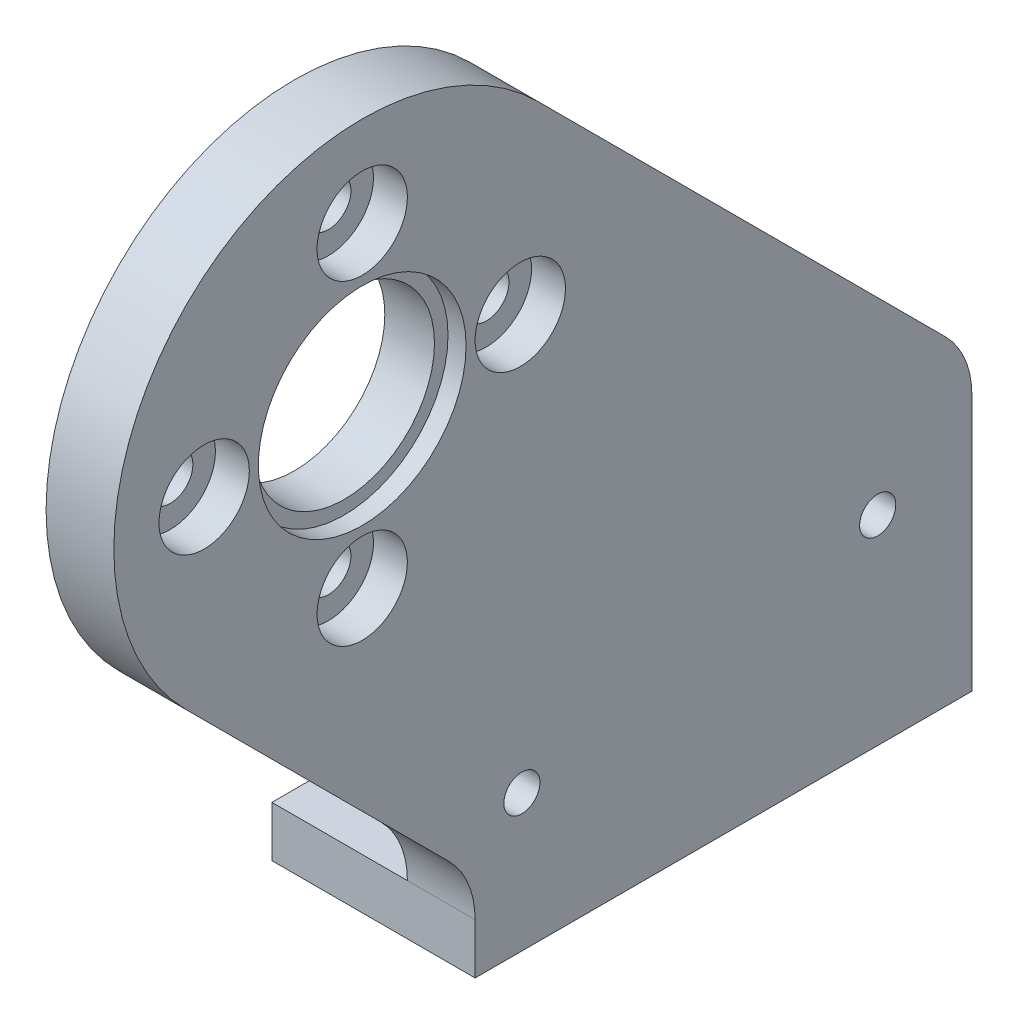
ISO-10303-21;
HEADER;
FILE_DESCRIPTION(('STEP AP214'),'2;1');
FILE_NAME('part.step','',(''),(''),'','','');
FILE_SCHEMA(('AUTOMOTIVE_DESIGN { 1 0 10303 214 1 1 1 1 }'));
ENDSEC;
DATA;
#1=APPLICATION_CONTEXT('core data for automotive mechanical design processes');
#2=APPLICATION_PROTOCOL_DEFINITION('international standard','automotive_design',2000,#1);
#3=PRODUCT_CONTEXT('',#1,'mechanical');
#4=PRODUCT('Part','Part','',(#3));
#5=PRODUCT_RELATED_PRODUCT_CATEGORY('part','',(#4));
#6=PRODUCT_DEFINITION_FORMATION('','',#4);
#7=PRODUCT_DEFINITION_CONTEXT('part definition',#1,'design');
#8=PRODUCT_DEFINITION('design','',#6,#7);
#9=PRODUCT_DEFINITION_SHAPE('','',#8);
#10=(LENGTH_UNIT() NAMED_UNIT(*) SI_UNIT(.MILLI.,.METRE.));
#11=(NAMED_UNIT(*) PLANE_ANGLE_UNIT() SI_UNIT($,.RADIAN.));
#12=(NAMED_UNIT(*) SI_UNIT($,.STERADIAN.) SOLID_ANGLE_UNIT());
#13=UNCERTAINTY_MEASURE_WITH_UNIT(LENGTH_MEASURE(1.E-05),#10,'distance_accuracy_value','');
#14=(GEOMETRIC_REPRESENTATION_CONTEXT(3) GLOBAL_UNCERTAINTY_ASSIGNED_CONTEXT((#13)) GLOBAL_UNIT_ASSIGNED_CONTEXT((#10,
#11,#12)) REPRESENTATION_CONTEXT('',''));
#15=CARTESIAN_POINT('',(0.,0.,0.));
#16=DIRECTION('',(0.,0.,1.));
#17=DIRECTION('',(1.,0.,0.));
#18=AXIS2_PLACEMENT_3D('',#15,#16,#17);
#19=CARTESIAN_POINT('',(69.5,-12.7999999999999,20.9999999999999));
#20=DIRECTION('',(-1.,0.,0.));
#21=DIRECTION('',(0.,0.,1.));
#22=AXIS2_PLACEMENT_3D('',#19,#20,#21);
#23=CYLINDRICAL_SURFACE('',#22,1.);
#24=CARTESIAN_POINT('',(60.,-12.7999999999999,20.9999999999999));
#25=DIRECTION('',(1.,0.,0.));
#26=DIRECTION('',(0.,0.,-1.));
#27=AXIS2_PLACEMENT_3D('',#24,#25,#26);
#28=CIRCLE('',#27,1.);
#29=CARTESIAN_POINT('',(60.,-12.7999999999999,19.9999999999999));
#30=VERTEX_POINT('',#29);
#31=EDGE_CURVE('E40',#30,#30,#28,.F.);
#32=ORIENTED_EDGE('',*,*,#31,.F.);
#33=EDGE_LOOP('',(#32));
#34=FACE_BOUND('',#33,.T.);
#35=CARTESIAN_POINT('',(58.5,-12.7999999999999,20.9999999999999));
#36=DIRECTION('',(-1.,0.,0.));
#37=DIRECTION('',(0.,0.,1.));
#38=AXIS2_PLACEMENT_3D('',#35,#36,#37);
#39=CIRCLE('',#38,1.);
#40=CARTESIAN_POINT('',(58.5,-12.7999999999999,21.9999999999999));
#41=VERTEX_POINT('',#40);
#42=EDGE_CURVE('E267',#41,#41,#39,.T.);
#43=ORIENTED_EDGE('',*,*,#42,.T.);
#44=EDGE_LOOP('',(#43));
#45=FACE_BOUND('',#44,.T.);
#46=ADVANCED_FACE('F36',(#34,#45),#23,.F.);
#47=CARTESIAN_POINT('',(69.5,-5.8,28.));
#48=DIRECTION('',(-1.,0.,0.));
#49=DIRECTION('',(0.,0.,1.));
#50=AXIS2_PLACEMENT_3D('',#47,#48,#49);
#51=CYLINDRICAL_SURFACE('',#50,1.);
#52=CARTESIAN_POINT('',(60.,-5.8,28.));
#53=DIRECTION('',(1.,0.,0.));
#54=DIRECTION('',(0.,0.,-1.));
#55=AXIS2_PLACEMENT_3D('',#52,#53,#54);
#56=CIRCLE('',#55,1.);
#57=CARTESIAN_POINT('',(60.,-5.8,27.));
#58=VERTEX_POINT('',#57);
#59=EDGE_CURVE('E252',#58,#58,#56,.F.);
#60=ORIENTED_EDGE('',*,*,#59,.F.);
#61=EDGE_LOOP('',(#60));
#62=FACE_BOUND('',#61,.T.);
#63=CARTESIAN_POINT('',(58.5,-5.8,28.));
#64=DIRECTION('',(-1.,0.,0.));
#65=DIRECTION('',(0.,0.,1.));
#66=AXIS2_PLACEMENT_3D('',#63,#64,#65);
#67=CIRCLE('',#66,1.);
#68=CARTESIAN_POINT('',(58.5,-5.8,29.));
#69=VERTEX_POINT('',#68);
#70=EDGE_CURVE('E269',#69,#69,#67,.T.);
#71=ORIENTED_EDGE('',*,*,#70,.T.);
#72=EDGE_LOOP('',(#71));
#73=FACE_BOUND('',#72,.T.);
#74=ADVANCED_FACE('F263',(#62,#73),#51,.F.);
#75=CARTESIAN_POINT('',(69.5,1.20000000000005,21.));
#76=DIRECTION('',(-1.,0.,0.));
#77=DIRECTION('',(0.,0.,1.));
#78=AXIS2_PLACEMENT_3D('',#75,#76,#77);
#79=CYLINDRICAL_SURFACE('',#78,1.);
#80=CARTESIAN_POINT('',(60.,1.20000000000005,21.));
#81=DIRECTION('',(1.,0.,0.));
#82=DIRECTION('',(0.,0.,-1.));
#83=AXIS2_PLACEMENT_3D('',#80,#81,#82);
#84=CIRCLE('',#83,1.);
#85=CARTESIAN_POINT('',(60.,1.20000000000005,20.));
#86=VERTEX_POINT('',#85);
#87=EDGE_CURVE('E152',#86,#86,#84,.F.);
#88=ORIENTED_EDGE('',*,*,#87,.F.);
#89=EDGE_LOOP('',(#88));
#90=FACE_BOUND('',#89,.T.);
#91=CARTESIAN_POINT('',(58.5,1.20000000000005,21.));
#92=DIRECTION('',(-1.,0.,0.));
#93=DIRECTION('',(0.,0.,1.));
#94=AXIS2_PLACEMENT_3D('',#91,#92,#93);
#95=CIRCLE('',#94,1.);
#96=CARTESIAN_POINT('',(58.5,1.20000000000005,22.));
#97=VERTEX_POINT('',#96);
#98=EDGE_CURVE('E273',#97,#97,#95,.T.);
#99=ORIENTED_EDGE('',*,*,#98,.T.);
#100=EDGE_LOOP('',(#99));
#101=FACE_BOUND('',#100,.T.);
#102=ADVANCED_FACE('F393',(#90,#101),#79,.F.);
#103=CARTESIAN_POINT('',(69.5,-5.79999999999995,14.));
#104=DIRECTION('',(-1.,0.,0.));
#105=DIRECTION('',(0.,0.,1.));
#106=AXIS2_PLACEMENT_3D('',#103,#104,#105);
#107=CYLINDRICAL_SURFACE('',#106,1.);
#108=CARTESIAN_POINT('',(60.,-5.79999999999995,14.));
#109=DIRECTION('',(1.,0.,0.));
#110=DIRECTION('',(0.,0.,-1.));
#111=AXIS2_PLACEMENT_3D('',#108,#109,#110);
#112=CIRCLE('',#111,1.);
#113=CARTESIAN_POINT('',(60.,-5.79999999999995,13.));
#114=VERTEX_POINT('',#113);
#115=EDGE_CURVE('E170',#114,#114,#112,.F.);
#116=ORIENTED_EDGE('',*,*,#115,.F.);
#117=EDGE_LOOP('',(#116));
#118=FACE_BOUND('',#117,.T.);
#119=CARTESIAN_POINT('',(58.5,-5.79999999999995,14.));
#120=DIRECTION('',(-1.,0.,0.));
#121=DIRECTION('',(0.,0.,1.));
#122=AXIS2_PLACEMENT_3D('',#119,#120,#121);
#123=CIRCLE('',#122,1.);
#124=CARTESIAN_POINT('',(58.5,-5.79999999999995,15.));
#125=VERTEX_POINT('',#124);
#126=EDGE_CURVE('E282',#125,#125,#123,.T.);
#127=ORIENTED_EDGE('',*,*,#126,.T.);
#128=EDGE_LOOP('',(#127));
#129=FACE_BOUND('',#128,.T.);
#130=ADVANCED_FACE('F396',(#118,#129),#107,.F.);
#131=CARTESIAN_POINT('',(60.5,-5.79999999999995,21.));
#132=DIRECTION('',(-1.,0.,0.));
#133=DIRECTION('',(0.,0.,-1.));
#134=AXIS2_PLACEMENT_3D('',#131,#132,#133);
#135=CYLINDRICAL_SURFACE('',#134,4.);
#136=CARTESIAN_POINT('',(60.7,-5.79999999999995,21.));
#137=DIRECTION('',(1.,0.,0.));
#138=DIRECTION('',(0.,0.,-1.));
#139=AXIS2_PLACEMENT_3D('',#136,#137,#138);
#140=CIRCLE('',#139,4.);
#141=CARTESIAN_POINT('',(60.7,-5.79999999999995,17.));
#142=VERTEX_POINT('',#141);
#143=EDGE_CURVE('E177',#142,#142,#140,.F.);
#144=ORIENTED_EDGE('',*,*,#143,.F.);
#145=EDGE_LOOP('',(#144));
#146=FACE_BOUND('',#145,.T.);
#147=CARTESIAN_POINT('',(58.5,-5.79999999999995,21.));
#148=DIRECTION('',(-1.,0.,0.));
#149=DIRECTION('',(0.,0.,1.));
#150=AXIS2_PLACEMENT_3D('',#147,#148,#149);
#151=CIRCLE('',#150,4.);
#152=CARTESIAN_POINT('',(58.5,-5.79999999999995,25.));
#153=VERTEX_POINT('',#152);
#154=EDGE_CURVE('E285',#153,#153,#151,.T.);
#155=ORIENTED_EDGE('',*,*,#154,.T.);
#156=EDGE_LOOP('',(#155));
#157=FACE_BOUND('',#156,.T.);
#158=ADVANCED_FACE('F403',(#146,#157),#135,.F.);
#159=CARTESIAN_POINT('',(61.61096680392,-28.0132034356,20.));
#160=DIRECTION('',(-1.,0.,0.));
#161=DIRECTION('',(0.,-0.707106781186548,0.707106781186548));
#162=AXIS2_PLACEMENT_3D('',#159,#160,#161);
#163=CYLINDRICAL_SURFACE('',#162,4.);
#164=DIRECTION('',(-1.,0.,0.));
#165=VECTOR('',#164,1.);
#166=CARTESIAN_POINT('',(61.5,-25.18477631085,17.171572875254));
#167=LINE('',#166,#165);
#168=CARTESIAN_POINT('',(61.5,-25.18477631085,17.171572875254));
#169=VERTEX_POINT('',#168);
#170=CARTESIAN_POINT('',(58.5,-25.1847763108514,17.1715728752554));
#171=VERTEX_POINT('',#170);
#172=EDGE_CURVE('E115',#169,#171,#167,.T.);
#173=ORIENTED_EDGE('',*,*,#172,.T.);
#174=CARTESIAN_POINT('',(58.5,-28.0132034356,20.));
#175=DIRECTION('',(1.,0.,0.));
#176=DIRECTION('',(0.,0.,1.));
#177=AXIS2_PLACEMENT_3D('',#174,#175,#176);
#178=CIRCLE('',#177,4.00000000000064);
#179=CARTESIAN_POINT('',(58.5,-28.0132034356,16.));
#180=VERTEX_POINT('',#179);
#181=EDGE_CURVE('E118',#180,#171,#178,.T.);
#182=ORIENTED_EDGE('',*,*,#181,.F.);
#183=DIRECTION('',(-1.,0.,0.));
#184=VECTOR('',#183,1.);
#185=CARTESIAN_POINT('',(61.54773426501,-28.0132034356,16.));
#186=LINE('',#185,#184);
#187=CARTESIAN_POINT('',(61.5,-28.0132034356,16.));
#188=VERTEX_POINT('',#187);
#189=EDGE_CURVE('E53',#188,#180,#186,.T.);
#190=ORIENTED_EDGE('',*,*,#189,.F.);
#191=CARTESIAN_POINT('',(61.5,-28.0132034356,20.));
#192=DIRECTION('',(-1.,0.,0.));
#193=DIRECTION('',(0.,0.707106781186548,-0.707106781186548));
#194=AXIS2_PLACEMENT_3D('',#191,#192,#193);
#195=CIRCLE('',#194,4.);
#196=EDGE_CURVE('E11',#169,#188,#195,.T.);
#197=ORIENTED_EDGE('',*,*,#196,.F.);
#198=EDGE_LOOP('',(#173,#182,#190,#197));
#199=FACE_BOUND('',#198,.T.);
#200=ADVANCED_FACE('F117',(#199),#163,.F.);
#201=CARTESIAN_POINT('',(60.93933982822,-28.86066017178,-6.));
#202=DIRECTION('',(0.,0.,-1.));
#203=DIRECTION('',(1.,0.,0.));
#204=AXIS2_PLACEMENT_3D('',#201,#202,#203);
#205=PLANE('',#204);
#206=DIRECTION('',(0.,-1.,2.95824592404915E-13));
#207=VECTOR('',#206,1.);
#208=CARTESIAN_POINT('',(58.5,-18.90050506339,-6.00000000000269));
#209=LINE('',#208,#207);
#210=CARTESIAN_POINT('',(58.5,-18.90050506339,-6.00000000000404));
#211=VERTEX_POINT('',#210);
#212=CARTESIAN_POINT('',(58.5,-28.0132034356,-6.));
#213=VERTEX_POINT('',#212);
#214=EDGE_CURVE('E288',#211,#213,#209,.T.);
#215=ORIENTED_EDGE('',*,*,#214,.F.);
#216=DIRECTION('',(1.,0.,0.));
#217=VECTOR('',#216,1.);
#218=CARTESIAN_POINT('',(59.5,-18.90050506339,-6.));
#219=LINE('',#218,#217);
#220=CARTESIAN_POINT('',(61.5,-18.90050506339,-6.));
#221=VERTEX_POINT('',#220);
#222=EDGE_CURVE('E123',#211,#221,#219,.T.);
#223=ORIENTED_EDGE('',*,*,#222,.T.);
#224=DIRECTION('',(0.,1.,0.));
#225=VECTOR('',#224,1.);
#226=CARTESIAN_POINT('',(61.5,-27.8,-6.));
#227=LINE('',#226,#225);
#228=CARTESIAN_POINT('',(61.5,-30.2494897427832,-6.));
#229=VERTEX_POINT('',#228);
#230=EDGE_CURVE('E45',#229,#221,#227,.T.);
#231=ORIENTED_EDGE('',*,*,#230,.F.);
#232=DIRECTION('',(-1.,0.,0.));
#233=VECTOR('',#232,1.);
#234=CARTESIAN_POINT('',(83.6415947150705,-30.2494897427832,-6.));
#235=LINE('',#234,#233);
#236=CARTESIAN_POINT('',(52.5,-30.2494897427832,-6.));
#237=VERTEX_POINT('',#236);
#238=EDGE_CURVE('E208',#229,#237,#235,.T.);
#239=ORIENTED_EDGE('',*,*,#238,.T.);
#240=DIRECTION('',(0.,-1.,0.));
#241=VECTOR('',#240,1.);
#242=CARTESIAN_POINT('',(52.5,-30.2494897427832,-6.));
#243=LINE('',#242,#241);
#244=CARTESIAN_POINT('',(52.5,-28.0132034356,-6.));
#245=VERTEX_POINT('',#244);
#246=EDGE_CURVE('E196',#245,#237,#243,.T.);
#247=ORIENTED_EDGE('',*,*,#246,.F.);
#248=DIRECTION('',(1.,0.,0.));
#249=VECTOR('',#248,1.);
#250=CARTESIAN_POINT('',(52.5,-28.0132034356,-6.));
#251=LINE('',#250,#249);
#252=EDGE_CURVE('E206',#245,#213,#251,.T.);
#253=ORIENTED_EDGE('',*,*,#252,.T.);
#254=EDGE_LOOP('',(#215,#223,#231,#239,#247,#253));
#255=FACE_BOUND('',#254,.T.);
#256=ADVANCED_FACE('F292',(#255),#205,.T.);
#257=CARTESIAN_POINT('',(60.93933982822,-28.86066017178,16.));
#258=DIRECTION('',(0.,0.,1.));
#259=DIRECTION('',(0.,1.,0.));
#260=AXIS2_PLACEMENT_3D('',#257,#258,#259);
#261=PLANE('',#260);
#262=ORIENTED_EDGE('',*,*,#189,.T.);
#263=DIRECTION('',(1.,0.,0.));
#264=VECTOR('',#263,1.);
#265=CARTESIAN_POINT('',(52.5,-28.0132034356,16.));
#266=LINE('',#265,#264);
#267=CARTESIAN_POINT('',(52.5,-28.0132034356,16.));
#268=VERTEX_POINT('',#267);
#269=EDGE_CURVE('E204',#268,#180,#266,.T.);
#270=ORIENTED_EDGE('',*,*,#269,.F.);
#271=DIRECTION('',(0.,1.,0.));
#272=VECTOR('',#271,1.);
#273=CARTESIAN_POINT('',(52.5,-28.0132034356,16.));
#274=LINE('',#273,#272);
#275=CARTESIAN_POINT('',(52.5,-30.2494897427832,16.));
#276=VERTEX_POINT('',#275);
#277=EDGE_CURVE('E202',#276,#268,#274,.T.);
#278=ORIENTED_EDGE('',*,*,#277,.F.);
#279=DIRECTION('',(-1.,0.,0.));
#280=VECTOR('',#279,1.);
#281=CARTESIAN_POINT('',(83.6415947150705,-30.2494897427832,16.));
#282=LINE('',#281,#280);
#283=CARTESIAN_POINT('',(61.5,-30.2494897427832,16.));
#284=VERTEX_POINT('',#283);
#285=EDGE_CURVE('E209',#284,#276,#282,.T.);
#286=ORIENTED_EDGE('',*,*,#285,.F.);
#287=DIRECTION('',(0.,1.,0.));
#288=VECTOR('',#287,1.);
#289=CARTESIAN_POINT('',(61.5,-28.86066017178,16.));
#290=LINE('',#289,#288);
#291=EDGE_CURVE('E211',#284,#188,#290,.T.);
#292=ORIENTED_EDGE('',*,*,#291,.T.);
#293=EDGE_LOOP('',(#262,#270,#278,#286,#292));
#294=FACE_BOUND('',#293,.T.);
#295=ADVANCED_FACE('F300',(#294),#261,.T.);
#296=CARTESIAN_POINT('',(61.5,-27.8,32.));
#297=DIRECTION('',(1.,0.,0.));
#298=DIRECTION('',(0.,-1.,0.));
#299=AXIS2_PLACEMENT_3D('',#296,#297,#298);
#300=PLANE('',#299);
#301=CARTESIAN_POINT('',(61.5,-12.7999999999999,20.9999999999999));
#302=DIRECTION('',(1.,0.,0.));
#303=DIRECTION('',(0.,0.,-1.));
#304=AXIS2_PLACEMENT_3D('',#301,#302,#303);
#305=CIRCLE('',#304,2.);
#306=CARTESIAN_POINT('',(61.5,-12.7999999999999,18.9999999999999));
#307=VERTEX_POINT('',#306);
#308=EDGE_CURVE('E153',#307,#307,#305,.T.);
#309=ORIENTED_EDGE('',*,*,#308,.F.);
#310=EDGE_LOOP('',(#309));
#311=FACE_BOUND('',#310,.T.);
#312=CARTESIAN_POINT('',(61.5,-5.8,28.));
#313=DIRECTION('',(1.,0.,0.));
#314=DIRECTION('',(0.,0.,-1.));
#315=AXIS2_PLACEMENT_3D('',#312,#313,#314);
#316=CIRCLE('',#315,2.);
#317=CARTESIAN_POINT('',(61.5,-5.8,26.));
#318=VERTEX_POINT('',#317);
#319=EDGE_CURVE('E159',#318,#318,#316,.T.);
#320=ORIENTED_EDGE('',*,*,#319,.F.);
#321=EDGE_LOOP('',(#320));
#322=FACE_BOUND('',#321,.T.);
#323=CARTESIAN_POINT('',(61.5,1.20000000000005,21.));
#324=DIRECTION('',(1.,0.,0.));
#325=DIRECTION('',(0.,0.,-1.));
#326=AXIS2_PLACEMENT_3D('',#323,#324,#325);
#327=CIRCLE('',#326,2.);
#328=CARTESIAN_POINT('',(61.5,1.20000000000005,19.));
#329=VERTEX_POINT('',#328);
#330=EDGE_CURVE('E148',#329,#329,#327,.T.);
#331=ORIENTED_EDGE('',*,*,#330,.F.);
#332=EDGE_LOOP('',(#331));
#333=FACE_BOUND('',#332,.T.);
#334=CARTESIAN_POINT('',(61.5,-5.79999999999995,14.));
#335=DIRECTION('',(1.,0.,0.));
#336=DIRECTION('',(0.,0.,-1.));
#337=AXIS2_PLACEMENT_3D('',#334,#335,#336);
#338=CIRCLE('',#337,2.);
#339=CARTESIAN_POINT('',(61.5,-5.79999999999995,12.));
#340=VERTEX_POINT('',#339);
#341=EDGE_CURVE('E171',#340,#340,#338,.T.);
#342=ORIENTED_EDGE('',*,*,#341,.F.);
#343=EDGE_LOOP('',(#342));
#344=FACE_BOUND('',#343,.T.);
#345=CARTESIAN_POINT('',(61.5,-5.80000000000003,21.0000000000001));
#346=DIRECTION('',(1.,0.,0.));
#347=DIRECTION('',(0.,0.,-1.));
#348=AXIS2_PLACEMENT_3D('',#345,#346,#347);
#349=CIRCLE('',#348,4.6);
#350=CARTESIAN_POINT('',(61.5,-5.80000000000003,16.4000000000001));
#351=VERTEX_POINT('',#350);
#352=EDGE_CURVE('E178',#351,#351,#349,.T.);
#353=ORIENTED_EDGE('',*,*,#352,.F.);
#354=EDGE_LOOP('',(#353));
#355=FACE_BOUND('',#354,.T.);
#356=ORIENTED_EDGE('',*,*,#196,.T.);
#357=ORIENTED_EDGE('',*,*,#291,.F.);
#358=DIRECTION('',(0.,0.,1.));
#359=VECTOR('',#358,1.);
#360=CARTESIAN_POINT('',(61.5,-30.2494897427832,32.));
#361=LINE('',#360,#359);
#362=EDGE_CURVE('E214',#229,#284,#361,.T.);
#363=ORIENTED_EDGE('',*,*,#362,.F.);
#364=ORIENTED_EDGE('',*,*,#230,.T.);
#365=CARTESIAN_POINT('',(61.5,-18.90050506339,-2.));
#366=DIRECTION('',(1.,0.,0.));
#367=DIRECTION('',(0.,0.,-1.));
#368=AXIS2_PLACEMENT_3D('',#365,#366,#367);
#369=CIRCLE('',#368,4.);
#370=CARTESIAN_POINT('',(61.5,-16.07207793864,-4.82842712475));
#371=VERTEX_POINT('',#370);
#372=EDGE_CURVE('E226',#221,#371,#369,.T.);
#373=ORIENTED_EDGE('',*,*,#372,.T.);
#374=DIRECTION('',(0.,-0.707106781186548,-0.707106781186548));
#375=VECTOR('',#374,1.);
#376=CARTESIAN_POINT('',(61.5,1.97817459305205,13.221825406948));
#377=LINE('',#376,#375);
#378=CARTESIAN_POINT('',(61.5,1.97817459305205,13.221825406948));
#379=VERTEX_POINT('',#378);
#380=EDGE_CURVE('E218',#379,#371,#377,.T.);
#381=ORIENTED_EDGE('',*,*,#380,.F.);
#382=CARTESIAN_POINT('',(61.5,-5.79999999999998,21.));
#383=DIRECTION('',(-1.,0.,0.));
#384=DIRECTION('',(0.,0.745298433795883,-0.666731013663985));
#385=AXIS2_PLACEMENT_3D('',#382,#383,#384);
#386=CIRCLE('',#385,11.);
#387=CARTESIAN_POINT('',(61.5,-13.578174593052,28.778174593052));
#388=VERTEX_POINT('',#387);
#389=EDGE_CURVE('E221',#388,#379,#386,.T.);
#390=ORIENTED_EDGE('',*,*,#389,.F.);
#391=DIRECTION('',(0.,0.707106781186548,0.707106781186548));
#392=VECTOR('',#391,1.);
#393=CARTESIAN_POINT('',(61.5,-25.18477631085,17.171572875254));
#394=LINE('',#393,#392);
#395=EDGE_CURVE('E122',#169,#388,#394,.T.);
#396=ORIENTED_EDGE('',*,*,#395,.F.);
#397=EDGE_LOOP('',(#356,#357,#363,#364,#373,#381,#390,#396));
#398=FACE_BOUND('',#397,.T.);
#399=CARTESIAN_POINT('',(61.5,-24.18477631085,13.928932188135));
#400=DIRECTION('',(-1.,0.,0.));
#401=DIRECTION('',(0.,-1.,0.));
#402=AXIS2_PLACEMENT_3D('',#399,#400,#401);
#403=CIRCLE('',#402,0.8);
#404=CARTESIAN_POINT('',(61.5,-24.98477631085,13.928932188135));
#405=VERTEX_POINT('',#404);
#406=EDGE_CURVE('E229',#405,#405,#403,.T.);
#407=ORIENTED_EDGE('',*,*,#406,.T.);
#408=EDGE_LOOP('',(#407));
#409=FACE_BOUND('',#408,.T.);
#410=CARTESIAN_POINT('',(61.5,-21.40640546818,-1.82799186006));
#411=DIRECTION('',(-1.,0.,0.));
#412=DIRECTION('',(0.,-1.,0.));
#413=AXIS2_PLACEMENT_3D('',#410,#411,#412);
#414=CIRCLE('',#413,0.8);
#415=CARTESIAN_POINT('',(61.5,-22.20640546818,-1.82799186006));
#416=VERTEX_POINT('',#415);
#417=EDGE_CURVE('E232',#416,#416,#414,.T.);
#418=ORIENTED_EDGE('',*,*,#417,.T.);
#419=EDGE_LOOP('',(#418));
#420=FACE_BOUND('',#419,.T.);
#421=ADVANCED_FACE('F302',(#311,#322,#333,#344,#355,#398,#409,#420),#300,.T.);
#422=CARTESIAN_POINT('',(59.40518465266,-18.90050506339,-2.));
#423=DIRECTION('',(1.,0.,0.));
#424=DIRECTION('',(0.,0.,1.));
#425=AXIS2_PLACEMENT_3D('',#422,#423,#424);
#426=CYLINDRICAL_SURFACE('',#425,4.);
#427=ORIENTED_EDGE('',*,*,#222,.F.);
#428=CARTESIAN_POINT('',(58.5,-18.90050506339,-2.));
#429=DIRECTION('',(-1.,0.,0.));
#430=DIRECTION('',(0.,0.,1.));
#431=AXIS2_PLACEMENT_3D('',#428,#429,#430);
#432=CIRCLE('',#431,4.00000000000404);
#433=CARTESIAN_POINT('',(58.5,-16.07207793864,-4.82842712475));
#434=VERTEX_POINT('',#433);
#435=EDGE_CURVE('E145',#434,#211,#432,.T.);
#436=ORIENTED_EDGE('',*,*,#435,.F.);
#437=DIRECTION('',(1.,0.,0.));
#438=VECTOR('',#437,1.);
#439=CARTESIAN_POINT('',(59.5,-16.07207793864,-4.82842712475));
#440=LINE('',#439,#438);
#441=EDGE_CURVE('E220',#434,#371,#440,.T.);
#442=ORIENTED_EDGE('',*,*,#441,.T.);
#443=ORIENTED_EDGE('',*,*,#372,.F.);
#444=EDGE_LOOP('',(#427,#436,#442,#443));
#445=FACE_BOUND('',#444,.T.);
#446=ADVANCED_FACE('F308',(#445),#426,.T.);
#447=CARTESIAN_POINT('',(60.5,-7.63273811042195,3.61091270347));
#448=DIRECTION('',(0.,-0.707106781186548,0.707106781186548));
#449=DIRECTION('',(0.,0.707106781186548,0.707106781186548));
#450=AXIS2_PLACEMENT_3D('',#447,#448,#449);
#451=PLANE('',#450);
#452=ORIENTED_EDGE('',*,*,#441,.F.);
#453=DIRECTION('',(0.,-0.707106781186431,-0.707106781186664));
#454=VECTOR('',#453,1.);
#455=CARTESIAN_POINT('',(58.5,1.97817459305204,13.221825406948));
#456=LINE('',#455,#454);
#457=CARTESIAN_POINT('',(58.5,1.97817459305204,13.221825406948));
#458=VERTEX_POINT('',#457);
#459=EDGE_CURVE('E139',#458,#434,#456,.T.);
#460=ORIENTED_EDGE('',*,*,#459,.F.);
#461=DIRECTION('',(-1.,0.,0.));
#462=VECTOR('',#461,1.);
#463=CARTESIAN_POINT('',(61.5,1.97817459305205,13.221825406948));
#464=LINE('',#463,#462);
#465=EDGE_CURVE('E223',#379,#458,#464,.T.);
#466=ORIENTED_EDGE('',*,*,#465,.F.);
#467=ORIENTED_EDGE('',*,*,#380,.T.);
#468=EDGE_LOOP('',(#452,#460,#466,#467));
#469=FACE_BOUND('',#468,.T.);
#470=ADVANCED_FACE('F430',(#469),#451,.F.);
#471=CARTESIAN_POINT('',(60.5,-5.79999999999998,21.));
#472=DIRECTION('',(-1.,0.,0.));
#473=DIRECTION('',(0.,0.,-1.));
#474=AXIS2_PLACEMENT_3D('',#471,#472,#473);
#475=CYLINDRICAL_SURFACE('',#474,11.);
#476=ORIENTED_EDGE('',*,*,#389,.T.);
#477=ORIENTED_EDGE('',*,*,#465,.T.);
#478=CARTESIAN_POINT('',(58.5,-5.79999999999998,21.));
#479=DIRECTION('',(-1.,0.,0.));
#480=DIRECTION('',(0.,0.,1.));
#481=AXIS2_PLACEMENT_3D('',#478,#479,#480);
#482=CIRCLE('',#481,11.);
#483=CARTESIAN_POINT('',(58.5,-13.578174593052,28.778174593052));
#484=VERTEX_POINT('',#483);
#485=EDGE_CURVE('E137',#484,#458,#482,.T.);
#486=ORIENTED_EDGE('',*,*,#485,.F.);
#487=DIRECTION('',(-1.,0.,0.));
#488=VECTOR('',#487,1.);
#489=CARTESIAN_POINT('',(61.5,-13.578174593052,28.778174593052));
#490=LINE('',#489,#488);
#491=EDGE_CURVE('E136',#388,#484,#490,.T.);
#492=ORIENTED_EDGE('',*,*,#491,.F.);
#493=EDGE_LOOP('',(#476,#477,#486,#492));
#494=FACE_BOUND('',#493,.T.);
#495=ADVANCED_FACE('F434',(#494),#475,.T.);
#496=CARTESIAN_POINT('',(60.5,-19.96726188958,22.389087296526));
#497=DIRECTION('',(0.,0.707106781186548,-0.707106781186548));
#498=DIRECTION('',(0.,-0.707106781186548,-0.707106781186548));
#499=AXIS2_PLACEMENT_3D('',#496,#497,#498);
#500=PLANE('',#499);
#501=ORIENTED_EDGE('',*,*,#491,.T.);
#502=DIRECTION('',(0.,0.707106781186603,0.707106781186492));
#503=VECTOR('',#502,1.);
#504=CARTESIAN_POINT('',(58.5,-25.1847763108509,17.1715728752549));
#505=LINE('',#504,#503);
#506=EDGE_CURVE('E131',#171,#484,#505,.T.);
#507=ORIENTED_EDGE('',*,*,#506,.F.);
#508=ORIENTED_EDGE('',*,*,#172,.F.);
#509=ORIENTED_EDGE('',*,*,#395,.T.);
#510=EDGE_LOOP('',(#501,#507,#508,#509));
#511=FACE_BOUND('',#510,.T.);
#512=ADVANCED_FACE('F134',(#511),#500,.F.);
#513=CARTESIAN_POINT('',(59.65,-24.18477631085,13.928932188135));
#514=DIRECTION('',(-1.,0.,0.));
#515=DIRECTION('',(0.,-1.,0.));
#516=AXIS2_PLACEMENT_3D('',#513,#514,#515);
#517=CONICAL_SURFACE('',#516,0.95,0.7853981625);
#518=CARTESIAN_POINT('',(59.5,-24.18477631085,13.928932188135));
#519=DIRECTION('',(-1.,0.,0.));
#520=DIRECTION('',(0.,0.,1.));
#521=AXIS2_PLACEMENT_3D('',#518,#519,#520);
#522=CIRCLE('',#521,1.1);
#523=CARTESIAN_POINT('',(59.5,-24.18477631085,15.028932188135));
#524=VERTEX_POINT('',#523);
#525=EDGE_CURVE('E276',#524,#524,#522,.T.);
#526=ORIENTED_EDGE('',*,*,#525,.T.);
#527=EDGE_LOOP('',(#526));
#528=FACE_BOUND('',#527,.T.);
#529=CARTESIAN_POINT('',(59.8,-24.18477631085,13.928932188135));
#530=DIRECTION('',(-1.,0.,0.));
#531=DIRECTION('',(0.,1.,0.));
#532=AXIS2_PLACEMENT_3D('',#529,#530,#531);
#533=CIRCLE('',#532,0.8);
#534=CARTESIAN_POINT('',(59.8,-23.38477631085,13.928932188135));
#535=VERTEX_POINT('',#534);
#536=EDGE_CURVE('E242',#535,#535,#533,.T.);
#537=ORIENTED_EDGE('',*,*,#536,.F.);
#538=EDGE_LOOP('',(#537));
#539=FACE_BOUND('',#538,.T.);
#540=ADVANCED_FACE('F314',(#528,#539),#517,.F.);
#541=CARTESIAN_POINT('',(62.10472291998,-24.18477631085,13.928932188135));
#542=DIRECTION('',(-1.,0.,0.));
#543=DIRECTION('',(0.,-1.,0.));
#544=AXIS2_PLACEMENT_3D('',#541,#542,#543);
#545=CYLINDRICAL_SURFACE('',#544,0.8);
#546=ORIENTED_EDGE('',*,*,#536,.T.);
#547=EDGE_LOOP('',(#546));
#548=FACE_BOUND('',#547,.T.);
#549=ORIENTED_EDGE('',*,*,#406,.F.);
#550=EDGE_LOOP('',(#549));
#551=FACE_BOUND('',#550,.T.);
#552=ADVANCED_FACE('F317',(#548,#551),#545,.F.);
#553=CARTESIAN_POINT('',(59.65,-21.40640546818,-1.82799186006));
#554=DIRECTION('',(-1.,0.,0.));
#555=DIRECTION('',(0.,-1.,0.));
#556=AXIS2_PLACEMENT_3D('',#553,#554,#555);
#557=CONICAL_SURFACE('',#556,0.95,0.7853981625);
#558=CARTESIAN_POINT('',(59.5,-21.40640546818,-1.82799186006));
#559=DIRECTION('',(-1.,0.,0.));
#560=DIRECTION('',(0.,0.,1.));
#561=AXIS2_PLACEMENT_3D('',#558,#559,#560);
#562=CIRCLE('',#561,1.1);
#563=CARTESIAN_POINT('',(59.5,-21.40640546818,-0.72799186006));
#564=VERTEX_POINT('',#563);
#565=EDGE_CURVE('E332',#564,#564,#562,.T.);
#566=ORIENTED_EDGE('',*,*,#565,.T.);
#567=EDGE_LOOP('',(#566));
#568=FACE_BOUND('',#567,.T.);
#569=CARTESIAN_POINT('',(59.8,-21.40640546818,-1.82799186006));
#570=DIRECTION('',(-1.,0.,0.));
#571=DIRECTION('',(0.,1.,0.));
#572=AXIS2_PLACEMENT_3D('',#569,#570,#571);
#573=CIRCLE('',#572,0.8);
#574=CARTESIAN_POINT('',(59.8,-20.60640546818,-1.82799186006));
#575=VERTEX_POINT('',#574);
#576=EDGE_CURVE('E217',#575,#575,#573,.T.);
#577=ORIENTED_EDGE('',*,*,#576,.F.);
#578=EDGE_LOOP('',(#577));
#579=FACE_BOUND('',#578,.T.);
#580=ADVANCED_FACE('F320',(#568,#579),#557,.F.);
#581=CARTESIAN_POINT('',(62.10472291998,-21.40640546818,-1.82799186006));
#582=DIRECTION('',(-1.,0.,0.));
#583=DIRECTION('',(0.,-1.,0.));
#584=AXIS2_PLACEMENT_3D('',#581,#582,#583);
#585=CYLINDRICAL_SURFACE('',#584,0.8);
#586=ORIENTED_EDGE('',*,*,#576,.T.);
#587=EDGE_LOOP('',(#586));
#588=FACE_BOUND('',#587,.T.);
#589=ORIENTED_EDGE('',*,*,#417,.F.);
#590=EDGE_LOOP('',(#589));
#591=FACE_BOUND('',#590,.T.);
#592=ADVANCED_FACE('F38',(#588,#591),#585,.F.);
#593=CARTESIAN_POINT('',(83.6415947150705,-30.2494897427832,-6.));
#594=DIRECTION('',(0.,-1.,0.));
#595=DIRECTION('',(0.,0.,-1.));
#596=AXIS2_PLACEMENT_3D('',#593,#594,#595);
#597=PLANE('',#596);
#598=CARTESIAN_POINT('',(55.5,-30.2494897427832,13.));
#599=DIRECTION('',(0.,-1.,0.));
#600=DIRECTION('',(0.,0.,-1.));
#601=AXIS2_PLACEMENT_3D('',#598,#599,#600);
#602=CIRCLE('',#601,0.999999999999998);
#603=CARTESIAN_POINT('',(55.5,-30.2494897427832,12.));
#604=VERTEX_POINT('',#603);
#605=EDGE_CURVE('E184',#604,#604,#602,.T.);
#606=ORIENTED_EDGE('',*,*,#605,.F.);
#607=EDGE_LOOP('',(#606));
#608=FACE_BOUND('',#607,.T.);
#609=CARTESIAN_POINT('',(55.5,-30.2494897427832,-3.04196010845019));
#610=DIRECTION('',(0.,-1.,0.));
#611=DIRECTION('',(0.,0.,-1.));
#612=AXIS2_PLACEMENT_3D('',#609,#610,#611);
#613=CIRCLE('',#612,0.999999999999998);
#614=CARTESIAN_POINT('',(55.5,-30.2494897427832,-4.04196010845019));
#615=VERTEX_POINT('',#614);
#616=EDGE_CURVE('E190',#615,#615,#613,.T.);
#617=ORIENTED_EDGE('',*,*,#616,.F.);
#618=EDGE_LOOP('',(#617));
#619=FACE_BOUND('',#618,.T.);
#620=ORIENTED_EDGE('',*,*,#238,.F.);
#621=ORIENTED_EDGE('',*,*,#362,.T.);
#622=ORIENTED_EDGE('',*,*,#285,.T.);
#623=DIRECTION('',(0.,0.,1.));
#624=VECTOR('',#623,1.);
#625=CARTESIAN_POINT('',(52.5,-30.2494897427832,16.));
#626=LINE('',#625,#624);
#627=EDGE_CURVE('E199',#237,#276,#626,.T.);
#628=ORIENTED_EDGE('',*,*,#627,.F.);
#629=EDGE_LOOP('',(#620,#621,#622,#628));
#630=FACE_BOUND('',#629,.T.);
#631=ADVANCED_FACE('F327',(#608,#619,#630),#597,.T.);
#632=CARTESIAN_POINT('',(52.5,-28.0132034356,-6.));
#633=DIRECTION('',(0.,-1.,0.));
#634=DIRECTION('',(0.,0.,-1.));
#635=AXIS2_PLACEMENT_3D('',#632,#633,#634);
#636=PLANE('',#635);
#637=CARTESIAN_POINT('',(55.5,-28.0132034356,13.));
#638=DIRECTION('',(0.,1.,0.));
#639=DIRECTION('',(0.,0.,1.));
#640=AXIS2_PLACEMENT_3D('',#637,#638,#639);
#641=CIRCLE('',#640,0.999999999999998);
#642=CARTESIAN_POINT('',(55.5,-28.0132034356,14.));
#643=VERTEX_POINT('',#642);
#644=EDGE_CURVE('E181',#643,#643,#641,.T.);
#645=ORIENTED_EDGE('',*,*,#644,.F.);
#646=EDGE_LOOP('',(#645));
#647=FACE_BOUND('',#646,.T.);
#648=CARTESIAN_POINT('',(55.5,-28.0132034356,-3.04196010845019));
#649=DIRECTION('',(0.,1.,0.));
#650=DIRECTION('',(0.,0.,1.));
#651=AXIS2_PLACEMENT_3D('',#648,#649,#650);
#652=CIRCLE('',#651,0.999999999999998);
#653=CARTESIAN_POINT('',(55.5,-28.0132034356,-2.04196010845019));
#654=VERTEX_POINT('',#653);
#655=EDGE_CURVE('E187',#654,#654,#652,.T.);
#656=ORIENTED_EDGE('',*,*,#655,.F.);
#657=EDGE_LOOP('',(#656));
#658=FACE_BOUND('',#657,.T.);
#659=ORIENTED_EDGE('',*,*,#269,.T.);
#660=DIRECTION('',(0.,0.,1.));
#661=VECTOR('',#660,1.);
#662=CARTESIAN_POINT('',(58.5,-28.0132034356,-6.));
#663=LINE('',#662,#661);
#664=EDGE_CURVE('E60',#213,#180,#663,.T.);
#665=ORIENTED_EDGE('',*,*,#664,.F.);
#666=ORIENTED_EDGE('',*,*,#252,.F.);
#667=DIRECTION('',(0.,0.,-1.));
#668=VECTOR('',#667,1.);
#669=CARTESIAN_POINT('',(52.5,-28.0132034356,-6.));
#670=LINE('',#669,#668);
#671=EDGE_CURVE('E193',#268,#245,#670,.T.);
#672=ORIENTED_EDGE('',*,*,#671,.F.);
#673=EDGE_LOOP('',(#659,#665,#666,#672));
#674=FACE_BOUND('',#673,.T.);
#675=ADVANCED_FACE('F294',(#647,#658,#674),#636,.F.);
#676=CARTESIAN_POINT('',(52.5,0.,0.));
#677=DIRECTION('',(1.,0.,0.));
#678=DIRECTION('',(0.,0.,-1.));
#679=AXIS2_PLACEMENT_3D('',#676,#677,#678);
#680=PLANE('',#679);
#681=ORIENTED_EDGE('',*,*,#671,.T.);
#682=ORIENTED_EDGE('',*,*,#246,.T.);
#683=ORIENTED_EDGE('',*,*,#627,.T.);
#684=ORIENTED_EDGE('',*,*,#277,.T.);
#685=EDGE_LOOP('',(#681,#682,#683,#684));
#686=FACE_BOUND('',#685,.T.);
#687=ADVANCED_FACE('F296',(#686),#680,.F.);
#688=CARTESIAN_POINT('',(55.5,-34.0132034356,-3.04196010845019));
#689=DIRECTION('',(0.,1.,0.));
#690=DIRECTION('',(0.,0.,1.));
#691=AXIS2_PLACEMENT_3D('',#688,#689,#690);
#692=CYLINDRICAL_SURFACE('',#691,0.999999999999998);
#693=ORIENTED_EDGE('',*,*,#616,.T.);
#694=EDGE_LOOP('',(#693));
#695=FACE_BOUND('',#694,.T.);
#696=ORIENTED_EDGE('',*,*,#655,.T.);
#697=EDGE_LOOP('',(#696));
#698=FACE_BOUND('',#697,.T.);
#699=ADVANCED_FACE('F415',(#695,#698),#692,.F.);
#700=CARTESIAN_POINT('',(55.5,-34.0132034356,13.));
#701=DIRECTION('',(0.,1.,0.));
#702=DIRECTION('',(0.,0.,1.));
#703=AXIS2_PLACEMENT_3D('',#700,#701,#702);
#704=CYLINDRICAL_SURFACE('',#703,0.999999999999998);
#705=ORIENTED_EDGE('',*,*,#605,.T.);
#706=EDGE_LOOP('',(#705));
#707=FACE_BOUND('',#706,.T.);
#708=ORIENTED_EDGE('',*,*,#644,.T.);
#709=EDGE_LOOP('',(#708));
#710=FACE_BOUND('',#709,.T.);
#711=ADVANCED_FACE('F408',(#707,#710),#704,.F.);
#712=CARTESIAN_POINT('',(60.7,-5.80000000000003,21.0000000000001));
#713=DIRECTION('',(1.,0.,0.));
#714=DIRECTION('',(0.,0.,-1.));
#715=AXIS2_PLACEMENT_3D('',#712,#713,#714);
#716=PLANE('',#715);
#717=CARTESIAN_POINT('',(60.7,-5.80000000000003,21.0000000000001));
#718=DIRECTION('',(1.,0.,0.));
#719=DIRECTION('',(0.,0.,-1.));
#720=AXIS2_PLACEMENT_3D('',#717,#718,#719);
#721=CIRCLE('',#720,4.6);
#722=CARTESIAN_POINT('',(60.7,-5.80000000000003,16.4000000000001));
#723=VERTEX_POINT('',#722);
#724=EDGE_CURVE('E174',#723,#723,#721,.T.);
#725=ORIENTED_EDGE('',*,*,#724,.T.);
#726=EDGE_LOOP('',(#725));
#727=FACE_BOUND('',#726,.T.);
#728=ORIENTED_EDGE('',*,*,#143,.T.);
#729=EDGE_LOOP('',(#728));
#730=FACE_BOUND('',#729,.T.);
#731=ADVANCED_FACE('F405',(#727,#730),#716,.T.);
#732=CARTESIAN_POINT('',(60.7,-5.80000000000003,21.0000000000001));
#733=DIRECTION('',(1.,0.,0.));
#734=DIRECTION('',(0.,0.,-1.));
#735=AXIS2_PLACEMENT_3D('',#732,#733,#734);
#736=CYLINDRICAL_SURFACE('',#735,4.6);
#737=ORIENTED_EDGE('',*,*,#724,.F.);
#738=EDGE_LOOP('',(#737));
#739=FACE_BOUND('',#738,.T.);
#740=ORIENTED_EDGE('',*,*,#352,.T.);
#741=EDGE_LOOP('',(#740));
#742=FACE_BOUND('',#741,.T.);
#743=ADVANCED_FACE('F388',(#739,#742),#736,.F.);
#744=CARTESIAN_POINT('',(60.,-5.79999999999995,14.));
#745=DIRECTION('',(1.,0.,0.));
#746=DIRECTION('',(0.,0.,-1.));
#747=AXIS2_PLACEMENT_3D('',#744,#745,#746);
#748=PLANE('',#747);
#749=CARTESIAN_POINT('',(60.,-5.79999999999995,14.));
#750=DIRECTION('',(1.,0.,0.));
#751=DIRECTION('',(0.,0.,-1.));
#752=AXIS2_PLACEMENT_3D('',#749,#750,#751);
#753=CIRCLE('',#752,2.);
#754=CARTESIAN_POINT('',(60.,-5.79999999999995,12.));
#755=VERTEX_POINT('',#754);
#756=EDGE_CURVE('E167',#755,#755,#753,.T.);
#757=ORIENTED_EDGE('',*,*,#756,.T.);
#758=EDGE_LOOP('',(#757));
#759=FACE_BOUND('',#758,.T.);
#760=ORIENTED_EDGE('',*,*,#115,.T.);
#761=EDGE_LOOP('',(#760));
#762=FACE_BOUND('',#761,.T.);
#763=ADVANCED_FACE('F385',(#759,#762),#748,.T.);
#764=CARTESIAN_POINT('',(60.,-5.79999999999995,14.));
#765=DIRECTION('',(1.,0.,0.));
#766=DIRECTION('',(0.,0.,-1.));
#767=AXIS2_PLACEMENT_3D('',#764,#765,#766);
#768=CYLINDRICAL_SURFACE('',#767,2.);
#769=ORIENTED_EDGE('',*,*,#756,.F.);
#770=EDGE_LOOP('',(#769));
#771=FACE_BOUND('',#770,.T.);
#772=ORIENTED_EDGE('',*,*,#341,.T.);
#773=EDGE_LOOP('',(#772));
#774=FACE_BOUND('',#773,.T.);
#775=ADVANCED_FACE('F380',(#771,#774),#768,.F.);
#776=CARTESIAN_POINT('',(60.,1.20000000000005,21.));
#777=DIRECTION('',(1.,0.,0.));
#778=DIRECTION('',(0.,0.,-1.));
#779=AXIS2_PLACEMENT_3D('',#776,#777,#778);
#780=PLANE('',#779);
#781=CARTESIAN_POINT('',(60.,1.20000000000005,21.));
#782=DIRECTION('',(1.,0.,0.));
#783=DIRECTION('',(0.,0.,-1.));
#784=AXIS2_PLACEMENT_3D('',#781,#782,#783);
#785=CIRCLE('',#784,2.);
#786=CARTESIAN_POINT('',(60.,1.20000000000005,19.));
#787=VERTEX_POINT('',#786);
#788=EDGE_CURVE('E162',#787,#787,#785,.T.);
#789=ORIENTED_EDGE('',*,*,#788,.T.);
#790=EDGE_LOOP('',(#789));
#791=FACE_BOUND('',#790,.T.);
#792=ORIENTED_EDGE('',*,*,#87,.T.);
#793=EDGE_LOOP('',(#792));
#794=FACE_BOUND('',#793,.T.);
#795=ADVANCED_FACE('F377',(#791,#794),#780,.T.);
#796=CARTESIAN_POINT('',(60.,1.20000000000005,21.));
#797=DIRECTION('',(1.,0.,0.));
#798=DIRECTION('',(0.,0.,-1.));
#799=AXIS2_PLACEMENT_3D('',#796,#797,#798);
#800=CYLINDRICAL_SURFACE('',#799,2.);
#801=ORIENTED_EDGE('',*,*,#788,.F.);
#802=EDGE_LOOP('',(#801));
#803=FACE_BOUND('',#802,.T.);
#804=ORIENTED_EDGE('',*,*,#330,.T.);
#805=EDGE_LOOP('',(#804));
#806=FACE_BOUND('',#805,.T.);
#807=ADVANCED_FACE('F372',(#803,#806),#800,.F.);
#808=CARTESIAN_POINT('',(60.,-5.8,28.));
#809=DIRECTION('',(1.,0.,0.));
#810=DIRECTION('',(0.,0.,-1.));
#811=AXIS2_PLACEMENT_3D('',#808,#809,#810);
#812=PLANE('',#811);
#813=CARTESIAN_POINT('',(60.,-5.8,28.));
#814=DIRECTION('',(1.,0.,0.));
#815=DIRECTION('',(0.,0.,-1.));
#816=AXIS2_PLACEMENT_3D('',#813,#814,#815);
#817=CIRCLE('',#816,2.);
#818=CARTESIAN_POINT('',(60.,-5.8,26.));
#819=VERTEX_POINT('',#818);
#820=EDGE_CURVE('E156',#819,#819,#817,.T.);
#821=ORIENTED_EDGE('',*,*,#820,.T.);
#822=EDGE_LOOP('',(#821));
#823=FACE_BOUND('',#822,.T.);
#824=ORIENTED_EDGE('',*,*,#59,.T.);
#825=EDGE_LOOP('',(#824));
#826=FACE_BOUND('',#825,.T.);
#827=ADVANCED_FACE('F369',(#823,#826),#812,.T.);
#828=CARTESIAN_POINT('',(60.,-5.8,28.));
#829=DIRECTION('',(1.,0.,0.));
#830=DIRECTION('',(0.,0.,-1.));
#831=AXIS2_PLACEMENT_3D('',#828,#829,#830);
#832=CYLINDRICAL_SURFACE('',#831,2.);
#833=ORIENTED_EDGE('',*,*,#820,.F.);
#834=EDGE_LOOP('',(#833));
#835=FACE_BOUND('',#834,.T.);
#836=ORIENTED_EDGE('',*,*,#319,.T.);
#837=EDGE_LOOP('',(#836));
#838=FACE_BOUND('',#837,.T.);
#839=ADVANCED_FACE('F364',(#835,#838),#832,.F.);
#840=CARTESIAN_POINT('',(60.,-12.7999999999999,20.9999999999999));
#841=DIRECTION('',(1.,0.,0.));
#842=DIRECTION('',(0.,0.,-1.));
#843=AXIS2_PLACEMENT_3D('',#840,#841,#842);
#844=PLANE('',#843);
#845=CARTESIAN_POINT('',(60.,-12.7999999999999,20.9999999999999));
#846=DIRECTION('',(1.,0.,0.));
#847=DIRECTION('',(0.,0.,-1.));
#848=AXIS2_PLACEMENT_3D('',#845,#846,#847);
#849=CIRCLE('',#848,2.);
#850=CARTESIAN_POINT('',(60.,-12.7999999999999,18.9999999999999));
#851=VERTEX_POINT('',#850);
#852=EDGE_CURVE('E149',#851,#851,#849,.T.);
#853=ORIENTED_EDGE('',*,*,#852,.T.);
#854=EDGE_LOOP('',(#853));
#855=FACE_BOUND('',#854,.T.);
#856=ORIENTED_EDGE('',*,*,#31,.T.);
#857=EDGE_LOOP('',(#856));
#858=FACE_BOUND('',#857,.T.);
#859=ADVANCED_FACE('F259',(#855,#858),#844,.T.);
#860=CARTESIAN_POINT('',(60.,-12.7999999999999,20.9999999999999));
#861=DIRECTION('',(1.,0.,0.));
#862=DIRECTION('',(0.,0.,-1.));
#863=AXIS2_PLACEMENT_3D('',#860,#861,#862);
#864=CYLINDRICAL_SURFACE('',#863,2.);
#865=ORIENTED_EDGE('',*,*,#852,.F.);
#866=EDGE_LOOP('',(#865));
#867=FACE_BOUND('',#866,.T.);
#868=ORIENTED_EDGE('',*,*,#308,.T.);
#869=EDGE_LOOP('',(#868));
#870=FACE_BOUND('',#869,.T.);
#871=ADVANCED_FACE('F358',(#867,#870),#864,.F.);
#872=CARTESIAN_POINT('',(58.5,-28.0132034356,20.));
#873=DIRECTION('',(-1.,0.,0.));
#874=DIRECTION('',(0.,0.,1.));
#875=AXIS2_PLACEMENT_3D('',#872,#873,#874);
#876=PLANE('',#875);
#877=CARTESIAN_POINT('',(58.5,-24.18477631085,13.928932188135));
#878=DIRECTION('',(-1.,0.,0.));
#879=DIRECTION('',(0.,0.,1.));
#880=AXIS2_PLACEMENT_3D('',#877,#878,#879);
#881=CIRCLE('',#880,1.1);
#882=CARTESIAN_POINT('',(58.5,-24.18477631085,15.028932188135));
#883=VERTEX_POINT('',#882);
#884=EDGE_CURVE('E270',#883,#883,#881,.T.);
#885=ORIENTED_EDGE('',*,*,#884,.F.);
#886=EDGE_LOOP('',(#885));
#887=FACE_BOUND('',#886,.T.);
#888=ORIENTED_EDGE('',*,*,#70,.F.);
#889=EDGE_LOOP('',(#888));
#890=FACE_BOUND('',#889,.T.);
#891=ORIENTED_EDGE('',*,*,#126,.F.);
#892=EDGE_LOOP('',(#891));
#893=FACE_BOUND('',#892,.T.);
#894=ORIENTED_EDGE('',*,*,#214,.T.);
#895=ORIENTED_EDGE('',*,*,#664,.T.);
#896=ORIENTED_EDGE('',*,*,#181,.T.);
#897=ORIENTED_EDGE('',*,*,#506,.T.);
#898=ORIENTED_EDGE('',*,*,#485,.T.);
#899=ORIENTED_EDGE('',*,*,#459,.T.);
#900=ORIENTED_EDGE('',*,*,#435,.T.);
#901=EDGE_LOOP('',(#894,#895,#896,#897,#898,#899,#900));
#902=FACE_BOUND('',#901,.T.);
#903=ORIENTED_EDGE('',*,*,#154,.F.);
#904=EDGE_LOOP('',(#903));
#905=FACE_BOUND('',#904,.T.);
#906=ORIENTED_EDGE('',*,*,#98,.F.);
#907=EDGE_LOOP('',(#906));
#908=FACE_BOUND('',#907,.T.);
#909=ORIENTED_EDGE('',*,*,#42,.F.);
#910=EDGE_LOOP('',(#909));
#911=FACE_BOUND('',#910,.T.);
#912=CARTESIAN_POINT('',(58.5,-21.40640546818,-1.82799186006));
#913=DIRECTION('',(-1.,0.,0.));
#914=DIRECTION('',(0.,0.,1.));
#915=AXIS2_PLACEMENT_3D('',#912,#913,#914);
#916=CIRCLE('',#915,1.1);
#917=CARTESIAN_POINT('',(58.5,-21.40640546818,-0.72799186006));
#918=VERTEX_POINT('',#917);
#919=EDGE_CURVE('E338',#918,#918,#916,.T.);
#920=ORIENTED_EDGE('',*,*,#919,.F.);
#921=EDGE_LOOP('',(#920));
#922=FACE_BOUND('',#921,.T.);
#923=ADVANCED_FACE('F128',(#887,#890,#893,#902,#905,#908,#911,#922),#876,.T.);
#924=CARTESIAN_POINT('',(58.5,-24.18477631085,13.928932188135));
#925=DIRECTION('',(1.,0.,0.));
#926=DIRECTION('',(0.,0.,-1.));
#927=AXIS2_PLACEMENT_3D('',#924,#925,#926);
#928=CYLINDRICAL_SURFACE('',#927,1.1);
#929=ORIENTED_EDGE('',*,*,#884,.T.);
#930=EDGE_LOOP('',(#929));
#931=FACE_BOUND('',#930,.T.);
#932=ORIENTED_EDGE('',*,*,#525,.F.);
#933=EDGE_LOOP('',(#932));
#934=FACE_BOUND('',#933,.T.);
#935=ADVANCED_FACE('F348',(#931,#934),#928,.F.);
#936=CARTESIAN_POINT('',(58.5,-21.40640546818,-1.82799186006));
#937=DIRECTION('',(1.,0.,0.));
#938=DIRECTION('',(0.,0.,-1.));
#939=AXIS2_PLACEMENT_3D('',#936,#937,#938);
#940=CYLINDRICAL_SURFACE('',#939,1.1);
#941=ORIENTED_EDGE('',*,*,#919,.T.);
#942=EDGE_LOOP('',(#941));
#943=FACE_BOUND('',#942,.T.);
#944=ORIENTED_EDGE('',*,*,#565,.F.);
#945=EDGE_LOOP('',(#944));
#946=FACE_BOUND('',#945,.T.);
#947=ADVANCED_FACE('F350',(#943,#946),#940,.F.);
#948=CLOSED_SHELL('',(#46,#74,#102,#130,#158,#200,#256,#295,#421,#446,#470,#495,#512,#540,#552,
#580,#592,#631,#675,#687,#699,#711,#731,#743,#763,#775,#795,#807,#827,#839,#859,#871,#923,#935,#947));
#949=MANIFOLD_SOLID_BREP('B2',#948);
#950=ADVANCED_BREP_SHAPE_REPRESENTATION('',(#18,#949),#14);
#951=SHAPE_DEFINITION_REPRESENTATION(#9,#950);
ENDSEC;
END-ISO-10303-21;
